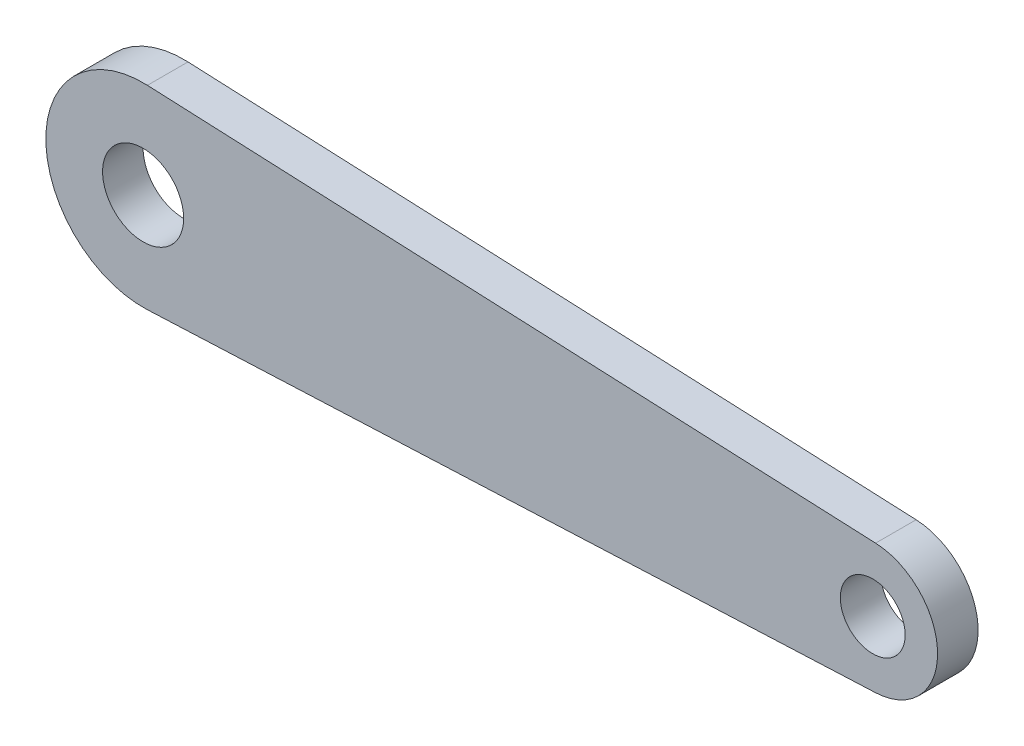
ISO-10303-21;
HEADER;
FILE_DESCRIPTION(('STEP AP214'),'2;1');
FILE_NAME('part.step','',(''),(''),'','','');
FILE_SCHEMA(('AUTOMOTIVE_DESIGN { 1 0 10303 214 1 1 1 1 }'));
ENDSEC;
DATA;
#1=APPLICATION_CONTEXT('core data for automotive mechanical design processes');
#2=APPLICATION_PROTOCOL_DEFINITION('international standard','automotive_design',2000,#1);
#3=PRODUCT_CONTEXT('',#1,'mechanical');
#4=PRODUCT('Part','Part','',(#3));
#5=PRODUCT_RELATED_PRODUCT_CATEGORY('part','',(#4));
#6=PRODUCT_DEFINITION_FORMATION('','',#4);
#7=PRODUCT_DEFINITION_CONTEXT('part definition',#1,'design');
#8=PRODUCT_DEFINITION('design','',#6,#7);
#9=PRODUCT_DEFINITION_SHAPE('','',#8);
#10=(LENGTH_UNIT() NAMED_UNIT(*) SI_UNIT(.MILLI.,.METRE.));
#11=(NAMED_UNIT(*) PLANE_ANGLE_UNIT() SI_UNIT($,.RADIAN.));
#12=(NAMED_UNIT(*) SI_UNIT($,.STERADIAN.) SOLID_ANGLE_UNIT());
#13=UNCERTAINTY_MEASURE_WITH_UNIT(LENGTH_MEASURE(1.E-05),#10,'distance_accuracy_value','');
#14=(GEOMETRIC_REPRESENTATION_CONTEXT(3) GLOBAL_UNCERTAINTY_ASSIGNED_CONTEXT((#13)) GLOBAL_UNIT_ASSIGNED_CONTEXT((#10,
#11,#12)) REPRESENTATION_CONTEXT('',''));
#15=CARTESIAN_POINT('',(0.,0.,0.));
#16=DIRECTION('',(0.,0.,1.));
#17=DIRECTION('',(1.,0.,0.));
#18=AXIS2_PLACEMENT_3D('',#15,#16,#17);
#19=CARTESIAN_POINT('',(0.,0.,3.175));
#20=DIRECTION('',(0.,0.,1.));
#21=DIRECTION('',(1.,0.,0.));
#22=AXIS2_PLACEMENT_3D('',#19,#20,#21);
#23=PLANE('',#22);
#24=CARTESIAN_POINT('',(0.,0.,3.175));
#25=DIRECTION('',(0.,0.,1.));
#26=DIRECTION('',(1.,0.,0.));
#27=AXIS2_PLACEMENT_3D('',#24,#25,#26);
#28=CIRCLE('',#27,3.175);
#29=CARTESIAN_POINT('',(3.175,0.,3.175));
#30=VERTEX_POINT('',#29);
#31=EDGE_CURVE('E99',#30,#30,#28,.T.);
#32=ORIENTED_EDGE('',*,*,#31,.F.);
#33=EDGE_LOOP('',(#32));
#34=FACE_BOUND('',#33,.T.);
#35=CARTESIAN_POINT('',(0.,0.,3.175));
#36=DIRECTION('',(0.,0.,1.));
#37=DIRECTION('',(1.,0.,0.));
#38=AXIS2_PLACEMENT_3D('',#35,#36,#37);
#39=CIRCLE('',#38,7.62);
#40=CARTESIAN_POINT('',(0.338666666666667,7.61247035389228,3.175));
#41=VERTEX_POINT('',#40);
#42=CARTESIAN_POINT('',(0.338666666666667,-7.61247035389228,3.175));
#43=VERTEX_POINT('',#42);
#44=EDGE_CURVE('E84',#41,#43,#39,.T.);
#45=ORIENTED_EDGE('',*,*,#44,.T.);
#46=DIRECTION('',(0.999011857466179,0.0444444444444444,0.));
#47=VECTOR('',#46,1.);
#48=CARTESIAN_POINT('',(57.3757777777778,-5.07498023592819,3.175));
#49=LINE('',#48,#47);
#50=CARTESIAN_POINT('',(57.3757777777778,-5.07498023592819,3.175));
#51=VERTEX_POINT('',#50);
#52=EDGE_CURVE('E79',#43,#51,#49,.T.);
#53=ORIENTED_EDGE('',*,*,#52,.T.);
#54=CARTESIAN_POINT('',(57.15,0.,3.175));
#55=DIRECTION('',(0.,0.,1.));
#56=DIRECTION('',(1.,0.,0.));
#57=AXIS2_PLACEMENT_3D('',#54,#55,#56);
#58=CIRCLE('',#57,5.08);
#59=CARTESIAN_POINT('',(57.3757777777778,5.07498023592819,3.175));
#60=VERTEX_POINT('',#59);
#61=EDGE_CURVE('E82',#51,#60,#58,.T.);
#62=ORIENTED_EDGE('',*,*,#61,.T.);
#63=DIRECTION('',(-0.999011857466179,0.0444444444444444,0.));
#64=VECTOR('',#63,1.);
#65=CARTESIAN_POINT('',(0.338666666666667,7.61247035389228,3.175));
#66=LINE('',#65,#64);
#67=EDGE_CURVE('E49',#60,#41,#66,.T.);
#68=ORIENTED_EDGE('',*,*,#67,.T.);
#69=EDGE_LOOP('',(#45,#53,#62,#68));
#70=FACE_BOUND('',#69,.T.);
#71=CARTESIAN_POINT('',(57.15,0.,3.175));
#72=DIRECTION('',(0.,0.,1.));
#73=DIRECTION('',(1.,0.,0.));
#74=AXIS2_PLACEMENT_3D('',#71,#72,#73);
#75=CIRCLE('',#74,2.54);
#76=CARTESIAN_POINT('',(59.69,0.,3.175));
#77=VERTEX_POINT('',#76);
#78=EDGE_CURVE('E114',#77,#77,#75,.T.);
#79=ORIENTED_EDGE('',*,*,#78,.F.);
#80=EDGE_LOOP('',(#79));
#81=FACE_BOUND('',#80,.T.);
#82=ADVANCED_FACE('F32',(#34,#70,#81),#23,.T.);
#83=CARTESIAN_POINT('',(0.,0.,0.));
#84=DIRECTION('',(0.,0.,1.));
#85=DIRECTION('',(1.,0.,0.));
#86=AXIS2_PLACEMENT_3D('',#83,#84,#85);
#87=PLANE('',#86);
#88=CARTESIAN_POINT('',(0.,0.,0.));
#89=DIRECTION('',(0.,0.,1.));
#90=DIRECTION('',(1.,0.,0.));
#91=AXIS2_PLACEMENT_3D('',#88,#89,#90);
#92=CIRCLE('',#91,7.62);
#93=CARTESIAN_POINT('',(0.338666666666667,7.61247035389228,0.));
#94=VERTEX_POINT('',#93);
#95=CARTESIAN_POINT('',(0.338666666666667,-7.61247035389228,0.));
#96=VERTEX_POINT('',#95);
#97=EDGE_CURVE('E96',#94,#96,#92,.T.);
#98=ORIENTED_EDGE('',*,*,#97,.F.);
#99=DIRECTION('',(-0.999011857466179,0.0444444444444444,0.));
#100=VECTOR('',#99,1.);
#101=CARTESIAN_POINT('',(0.338666666666667,7.61247035389228,0.));
#102=LINE('',#101,#100);
#103=CARTESIAN_POINT('',(57.3757777777778,5.07498023592819,0.));
#104=VERTEX_POINT('',#103);
#105=EDGE_CURVE('E72',#104,#94,#102,.T.);
#106=ORIENTED_EDGE('',*,*,#105,.F.);
#107=CARTESIAN_POINT('',(57.15,0.,0.));
#108=DIRECTION('',(0.,0.,1.));
#109=DIRECTION('',(1.,0.,0.));
#110=AXIS2_PLACEMENT_3D('',#107,#108,#109);
#111=CIRCLE('',#110,5.08);
#112=CARTESIAN_POINT('',(57.3757777777778,-5.07498023592819,0.));
#113=VERTEX_POINT('',#112);
#114=EDGE_CURVE('E66',#113,#104,#111,.T.);
#115=ORIENTED_EDGE('',*,*,#114,.F.);
#116=DIRECTION('',(0.999011857466179,0.0444444444444444,0.));
#117=VECTOR('',#116,1.);
#118=CARTESIAN_POINT('',(57.3757777777778,-5.07498023592819,0.));
#119=LINE('',#118,#117);
#120=EDGE_CURVE('E88',#96,#113,#119,.T.);
#121=ORIENTED_EDGE('',*,*,#120,.F.);
#122=EDGE_LOOP('',(#98,#106,#115,#121));
#123=FACE_BOUND('',#122,.T.);
#124=CARTESIAN_POINT('',(0.,0.,0.));
#125=DIRECTION('',(0.,0.,1.));
#126=DIRECTION('',(1.,0.,0.));
#127=AXIS2_PLACEMENT_3D('',#124,#125,#126);
#128=CIRCLE('',#127,3.175);
#129=CARTESIAN_POINT('',(3.175,0.,0.));
#130=VERTEX_POINT('',#129);
#131=EDGE_CURVE('E111',#130,#130,#128,.T.);
#132=ORIENTED_EDGE('',*,*,#131,.T.);
#133=EDGE_LOOP('',(#132));
#134=FACE_BOUND('',#133,.T.);
#135=CARTESIAN_POINT('',(57.15,0.,0.));
#136=DIRECTION('',(0.,0.,1.));
#137=DIRECTION('',(1.,0.,0.));
#138=AXIS2_PLACEMENT_3D('',#135,#136,#137);
#139=CIRCLE('',#138,2.54);
#140=CARTESIAN_POINT('',(59.69,0.,0.));
#141=VERTEX_POINT('',#140);
#142=EDGE_CURVE('E117',#141,#141,#139,.T.);
#143=ORIENTED_EDGE('',*,*,#142,.T.);
#144=EDGE_LOOP('',(#143));
#145=FACE_BOUND('',#144,.T.);
#146=ADVANCED_FACE('F107',(#123,#134,#145),#87,.F.);
#147=CARTESIAN_POINT('',(0.,0.,3.175));
#148=DIRECTION('',(0.,0.,-1.));
#149=DIRECTION('',(-1.,0.,0.));
#150=AXIS2_PLACEMENT_3D('',#147,#148,#149);
#151=CYLINDRICAL_SURFACE('',#150,7.62);
#152=ORIENTED_EDGE('',*,*,#97,.T.);
#153=DIRECTION('',(0.,0.,-1.));
#154=VECTOR('',#153,1.);
#155=CARTESIAN_POINT('',(0.338666666666667,-7.61247035389228,3.175));
#156=LINE('',#155,#154);
#157=EDGE_CURVE('E11',#43,#96,#156,.T.);
#158=ORIENTED_EDGE('',*,*,#157,.F.);
#159=ORIENTED_EDGE('',*,*,#44,.F.);
#160=DIRECTION('',(0.,0.,-1.));
#161=VECTOR('',#160,1.);
#162=CARTESIAN_POINT('',(0.338666666666667,7.61247035389228,3.175));
#163=LINE('',#162,#161);
#164=EDGE_CURVE('E92',#41,#94,#163,.T.);
#165=ORIENTED_EDGE('',*,*,#164,.T.);
#166=EDGE_LOOP('',(#152,#158,#159,#165));
#167=FACE_BOUND('',#166,.T.);
#168=ADVANCED_FACE('F34',(#167),#151,.T.);
#169=CARTESIAN_POINT('',(57.3757777777778,-5.07498023592819,3.175));
#170=DIRECTION('',(-0.0444444444444444,0.999011857466179,0.));
#171=DIRECTION('',(-0.999011857466179,-0.0444444444444444,0.));
#172=AXIS2_PLACEMENT_3D('',#169,#170,#171);
#173=PLANE('',#172);
#174=ORIENTED_EDGE('',*,*,#120,.T.);
#175=DIRECTION('',(0.,0.,-1.));
#176=VECTOR('',#175,1.);
#177=CARTESIAN_POINT('',(57.3757777777778,-5.07498023592819,3.175));
#178=LINE('',#177,#176);
#179=EDGE_CURVE('E41',#51,#113,#178,.T.);
#180=ORIENTED_EDGE('',*,*,#179,.F.);
#181=ORIENTED_EDGE('',*,*,#52,.F.);
#182=ORIENTED_EDGE('',*,*,#157,.T.);
#183=EDGE_LOOP('',(#174,#180,#181,#182));
#184=FACE_BOUND('',#183,.T.);
#185=ADVANCED_FACE('F87',(#184),#173,.F.);
#186=CARTESIAN_POINT('',(57.15,0.,3.175));
#187=DIRECTION('',(0.,0.,-1.));
#188=DIRECTION('',(-1.,0.,0.));
#189=AXIS2_PLACEMENT_3D('',#186,#187,#188);
#190=CYLINDRICAL_SURFACE('',#189,5.08);
#191=ORIENTED_EDGE('',*,*,#114,.T.);
#192=DIRECTION('',(0.,0.,-1.));
#193=VECTOR('',#192,1.);
#194=CARTESIAN_POINT('',(57.3757777777778,5.07498023592819,3.175));
#195=LINE('',#194,#193);
#196=EDGE_CURVE('E89',#60,#104,#195,.T.);
#197=ORIENTED_EDGE('',*,*,#196,.F.);
#198=ORIENTED_EDGE('',*,*,#61,.F.);
#199=ORIENTED_EDGE('',*,*,#179,.T.);
#200=EDGE_LOOP('',(#191,#197,#198,#199));
#201=FACE_BOUND('',#200,.T.);
#202=ADVANCED_FACE('F90',(#201),#190,.T.);
#203=CARTESIAN_POINT('',(0.338666666666667,7.61247035389228,3.175));
#204=DIRECTION('',(-0.0444444444444444,-0.999011857466179,0.));
#205=DIRECTION('',(0.999011857466179,-0.0444444444444444,0.));
#206=AXIS2_PLACEMENT_3D('',#203,#204,#205);
#207=PLANE('',#206);
#208=ORIENTED_EDGE('',*,*,#105,.T.);
#209=ORIENTED_EDGE('',*,*,#164,.F.);
#210=ORIENTED_EDGE('',*,*,#67,.F.);
#211=ORIENTED_EDGE('',*,*,#196,.T.);
#212=EDGE_LOOP('',(#208,#209,#210,#211));
#213=FACE_BOUND('',#212,.T.);
#214=ADVANCED_FACE('F104',(#213),#207,.F.);
#215=CARTESIAN_POINT('',(0.,0.,3.175));
#216=DIRECTION('',(0.,0.,-1.));
#217=DIRECTION('',(-1.,0.,0.));
#218=AXIS2_PLACEMENT_3D('',#215,#216,#217);
#219=CYLINDRICAL_SURFACE('',#218,3.175);
#220=ORIENTED_EDGE('',*,*,#31,.T.);
#221=EDGE_LOOP('',(#220));
#222=FACE_BOUND('',#221,.T.);
#223=ORIENTED_EDGE('',*,*,#131,.F.);
#224=EDGE_LOOP('',(#223));
#225=FACE_BOUND('',#224,.T.);
#226=ADVANCED_FACE('F134',(#222,#225),#219,.F.);
#227=CARTESIAN_POINT('',(57.15,0.,3.175));
#228=DIRECTION('',(0.,0.,-1.));
#229=DIRECTION('',(-1.,0.,0.));
#230=AXIS2_PLACEMENT_3D('',#227,#228,#229);
#231=CYLINDRICAL_SURFACE('',#230,2.54);
#232=ORIENTED_EDGE('',*,*,#78,.T.);
#233=EDGE_LOOP('',(#232));
#234=FACE_BOUND('',#233,.T.);
#235=ORIENTED_EDGE('',*,*,#142,.F.);
#236=EDGE_LOOP('',(#235));
#237=FACE_BOUND('',#236,.T.);
#238=ADVANCED_FACE('F123',(#234,#237),#231,.F.);
#239=CLOSED_SHELL('',(#82,#146,#168,#185,#202,#214,#226,#238));
#240=MANIFOLD_SOLID_BREP('B2',#239);
#241=ADVANCED_BREP_SHAPE_REPRESENTATION('',(#18,#240),#14);
#242=SHAPE_DEFINITION_REPRESENTATION(#9,#241);
ENDSEC;
END-ISO-10303-21;
